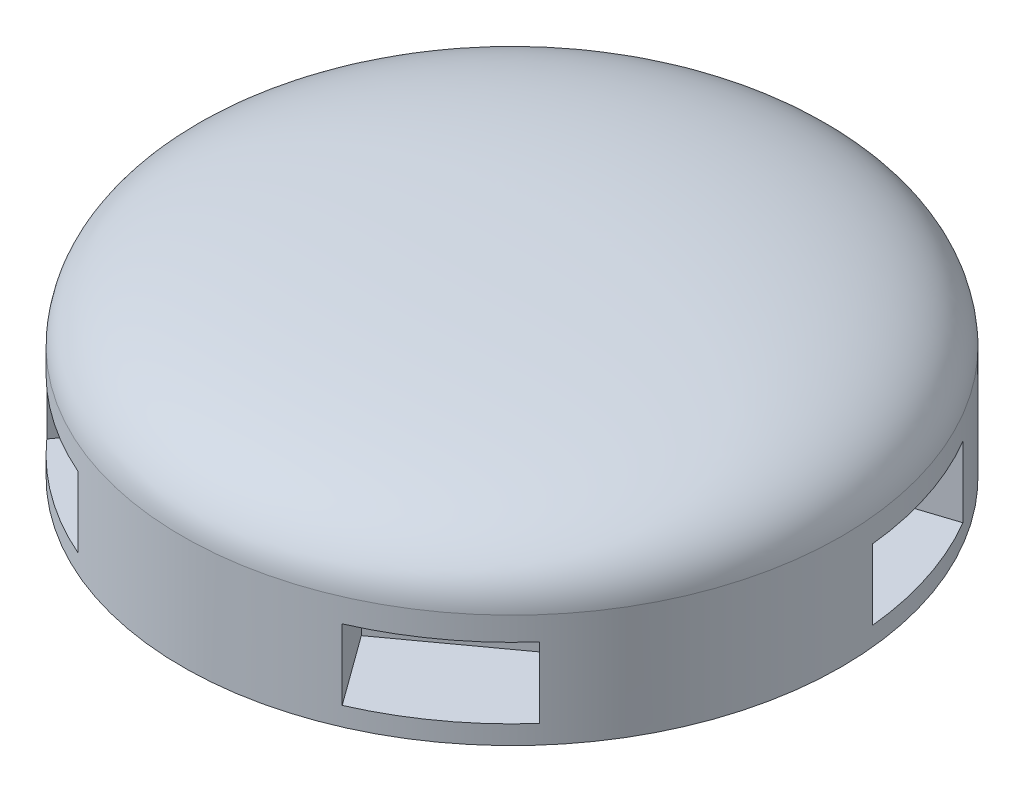
ISO-10303-21;
HEADER;
FILE_DESCRIPTION(('STEP AP214'),'2;1');
FILE_NAME('part.step','',(''),(''),'','','');
FILE_SCHEMA(('AUTOMOTIVE_DESIGN { 1 0 10303 214 1 1 1 1 }'));
ENDSEC;
DATA;
#1=APPLICATION_CONTEXT('core data for automotive mechanical design processes');
#2=APPLICATION_PROTOCOL_DEFINITION('international standard','automotive_design',2000,#1);
#3=PRODUCT_CONTEXT('',#1,'mechanical');
#4=PRODUCT('Part','Part','',(#3));
#5=PRODUCT_RELATED_PRODUCT_CATEGORY('part','',(#4));
#6=PRODUCT_DEFINITION_FORMATION('','',#4);
#7=PRODUCT_DEFINITION_CONTEXT('part definition',#1,'design');
#8=PRODUCT_DEFINITION('design','',#6,#7);
#9=PRODUCT_DEFINITION_SHAPE('','',#8);
#10=(LENGTH_UNIT() NAMED_UNIT(*) SI_UNIT(.MILLI.,.METRE.));
#11=(NAMED_UNIT(*) PLANE_ANGLE_UNIT() SI_UNIT($,.RADIAN.));
#12=(NAMED_UNIT(*) SI_UNIT($,.STERADIAN.) SOLID_ANGLE_UNIT());
#13=UNCERTAINTY_MEASURE_WITH_UNIT(LENGTH_MEASURE(1.E-05),#10,'distance_accuracy_value','');
#14=(GEOMETRIC_REPRESENTATION_CONTEXT(3) GLOBAL_UNCERTAINTY_ASSIGNED_CONTEXT((#13)) GLOBAL_UNIT_ASSIGNED_CONTEXT((#10,
#11,#12)) REPRESENTATION_CONTEXT('',''));
#15=CARTESIAN_POINT('',(0.,0.,0.));
#16=DIRECTION('',(0.,0.,1.));
#17=DIRECTION('',(1.,0.,0.));
#18=AXIS2_PLACEMENT_3D('',#15,#16,#17);
#19=CARTESIAN_POINT('',(35.,9.99999999999998,0.));
#20=CARTESIAN_POINT('',(34.8017931901627,13.4310967656326,0.));
#21=CARTESIAN_POINT('',(32.349399846197,20.,0.));
#22=CARTESIAN_POINT('',(0.,20.,0.));
#23=B_SPLINE_CURVE_WITH_KNOTS('',3,(#19,#20,#21,#22),.UNSPECIFIED.,.F.,.F.,(4,4),(0.,1.),.UNSPECIFIED.);
#24=CARTESIAN_POINT('',(0.,20.,0.));
#25=DIRECTION('',(0.,1.,0.));
#26=AXIS1_PLACEMENT('',#24,#25);
#27=SURFACE_OF_REVOLUTION('',#23,#26);
#28=CARTESIAN_POINT('',(0.,20.,0.));
#29=VERTEX_POINT('',#28);
#30=VERTEX_LOOP('',#29);
#31=FACE_BOUND('',#30,.T.);
#32=CARTESIAN_POINT('',(0.,10.,0.));
#33=DIRECTION('',(0.,1.,0.));
#34=DIRECTION('',(-1.,0.,0.));
#35=AXIS2_PLACEMENT_3D('',#32,#33,#34);
#36=CIRCLE('',#35,35.);
#37=CARTESIAN_POINT('',(-35.,10.,0.));
#38=VERTEX_POINT('',#37);
#39=EDGE_CURVE('E257',#38,#38,#36,.T.);
#40=ORIENTED_EDGE('',*,*,#39,.T.);
#41=EDGE_LOOP('',(#40));
#42=FACE_BOUND('',#41,.T.);
#43=ADVANCED_FACE('F39',(#31,#42),#27,.T.);
#44=CARTESIAN_POINT('',(0.,20.,0.));
#45=DIRECTION('',(0.,1.,0.));
#46=DIRECTION('',(-1.,0.,0.));
#47=AXIS2_PLACEMENT_3D('',#44,#45,#46);
#48=CYLINDRICAL_SURFACE('',#47,35.);
#49=CARTESIAN_POINT('',(0.,0.,0.));
#50=DIRECTION('',(0.,-1.,0.));
#51=DIRECTION('',(1.,0.,0.));
#52=AXIS2_PLACEMENT_3D('',#49,#50,#51);
#53=CIRCLE('',#52,35.);
#54=CARTESIAN_POINT('',(-7.5,0.,-34.1869858279434));
#55=VERTEX_POINT('',#54);
#56=CARTESIAN_POINT('',(7.5,0.,-34.1869858279434));
#57=VERTEX_POINT('',#56);
#58=EDGE_CURVE('E237',#55,#57,#53,.T.);
#59=ORIENTED_EDGE('',*,*,#58,.T.);
#60=DIRECTION('',(0.,1.,0.));
#61=VECTOR('',#60,1.);
#62=CARTESIAN_POINT('',(7.5,20.,-34.1869858279434));
#63=LINE('',#62,#61);
#64=CARTESIAN_POINT('',(7.5,7.5,-34.1869858279434));
#65=VERTEX_POINT('',#64);
#66=EDGE_CURVE('E11',#57,#65,#63,.T.);
#67=ORIENTED_EDGE('',*,*,#66,.T.);
#68=CARTESIAN_POINT('',(0.,7.5,0.));
#69=DIRECTION('',(0.,1.,0.));
#70=DIRECTION('',(-1.,0.,0.));
#71=AXIS2_PLACEMENT_3D('',#68,#69,#70);
#72=CIRCLE('',#71,35.);
#73=CARTESIAN_POINT('',(-7.5,7.5,-34.1869858279434));
#74=VERTEX_POINT('',#73);
#75=EDGE_CURVE('E231',#65,#74,#72,.T.);
#76=ORIENTED_EDGE('',*,*,#75,.T.);
#77=DIRECTION('',(0.,1.,0.));
#78=VECTOR('',#77,1.);
#79=CARTESIAN_POINT('',(-7.5,20.,-34.1869858279434));
#80=LINE('',#79,#78);
#81=EDGE_CURVE('E47',#74,#55,#80,.F.);
#82=ORIENTED_EDGE('',*,*,#81,.T.);
#83=EDGE_LOOP('',(#59,#67,#76,#82));
#84=FACE_BOUND('',#83,.T.);
#85=CARTESIAN_POINT('',(30.1961281863433,0.,-17.697283479504));
#86=VERTEX_POINT('',#85);
#87=CARTESIAN_POINT('',(34.8313831019677,0.,-3.43143573507673));
#88=VERTEX_POINT('',#87);
#89=EDGE_CURVE('E194',#86,#88,#53,.T.);
#90=ORIENTED_EDGE('',*,*,#89,.T.);
#91=DIRECTION('',(0.,1.,0.));
#92=VECTOR('',#91,1.);
#93=CARTESIAN_POINT('',(34.8313831019677,20.,-3.43143573507673));
#94=LINE('',#93,#92);
#95=CARTESIAN_POINT('',(34.8313831019677,7.5,-3.43143573507673));
#96=VERTEX_POINT('',#95);
#97=EDGE_CURVE('E212',#88,#96,#94,.T.);
#98=ORIENTED_EDGE('',*,*,#97,.T.);
#99=CARTESIAN_POINT('',(0.,7.5,0.));
#100=DIRECTION('',(0.,-1.,0.));
#101=DIRECTION('',(1.,0.,0.));
#102=AXIS2_PLACEMENT_3D('',#99,#100,#101);
#103=CIRCLE('',#102,35.);
#104=CARTESIAN_POINT('',(30.1961281863433,7.5,-17.697283479504));
#105=VERTEX_POINT('',#104);
#106=EDGE_CURVE('E346',#105,#96,#103,.T.);
#107=ORIENTED_EDGE('',*,*,#106,.F.);
#108=DIRECTION('',(0.,1.,0.));
#109=VECTOR('',#108,1.);
#110=CARTESIAN_POINT('',(30.1961281863433,20.,-17.697283479504));
#111=LINE('',#110,#109);
#112=EDGE_CURVE('E348',#105,#86,#111,.F.);
#113=ORIENTED_EDGE('',*,*,#112,.T.);
#114=EDGE_LOOP('',(#90,#98,#107,#113));
#115=FACE_BOUND('',#114,.T.);
#116=CARTESIAN_POINT('',(26.1622335478092,0.,23.2494631290679));
#117=VERTEX_POINT('',#116);
#118=CARTESIAN_POINT('',(14.0269786321851,0.,32.0662419134551));
#119=VERTEX_POINT('',#118);
#120=EDGE_CURVE('E180',#117,#119,#53,.T.);
#121=ORIENTED_EDGE('',*,*,#120,.T.);
#122=DIRECTION('',(0.,1.,0.));
#123=VECTOR('',#122,1.);
#124=CARTESIAN_POINT('',(14.0269786321851,20.,32.0662419134551));
#125=LINE('',#124,#123);
#126=CARTESIAN_POINT('',(14.0269786321851,7.5,32.0662419134551));
#127=VERTEX_POINT('',#126);
#128=EDGE_CURVE('E208',#119,#127,#125,.T.);
#129=ORIENTED_EDGE('',*,*,#128,.T.);
#130=CARTESIAN_POINT('',(0.,7.5,0.));
#131=DIRECTION('',(0.,-1.,0.));
#132=DIRECTION('',(1.,0.,0.));
#133=AXIS2_PLACEMENT_3D('',#130,#131,#132);
#134=CIRCLE('',#133,35.);
#135=CARTESIAN_POINT('',(26.1622335478092,7.5,23.2494631290679));
#136=VERTEX_POINT('',#135);
#137=EDGE_CURVE('E207',#136,#127,#134,.T.);
#138=ORIENTED_EDGE('',*,*,#137,.F.);
#139=DIRECTION('',(0.,1.,0.));
#140=VECTOR('',#139,1.);
#141=CARTESIAN_POINT('',(26.1622335478092,20.,23.2494631290679));
#142=LINE('',#141,#140);
#143=EDGE_CURVE('E199',#136,#117,#142,.F.);
#144=ORIENTED_EDGE('',*,*,#143,.T.);
#145=EDGE_LOOP('',(#121,#129,#138,#144));
#146=FACE_BOUND('',#145,.T.);
#147=CARTESIAN_POINT('',(-14.0269786321846,0.,32.0662419134553));
#148=VERTEX_POINT('',#147);
#149=CARTESIAN_POINT('',(-26.1622335478089,0.,23.2494631290683));
#150=VERTEX_POINT('',#149);
#151=EDGE_CURVE('E192',#148,#150,#53,.T.);
#152=ORIENTED_EDGE('',*,*,#151,.T.);
#153=DIRECTION('',(0.,1.,0.));
#154=VECTOR('',#153,1.);
#155=CARTESIAN_POINT('',(-26.1622335478089,20.,23.2494631290683));
#156=LINE('',#155,#154);
#157=CARTESIAN_POINT('',(-26.1622335478089,7.5,23.2494631290683));
#158=VERTEX_POINT('',#157);
#159=EDGE_CURVE('E220',#150,#158,#156,.T.);
#160=ORIENTED_EDGE('',*,*,#159,.T.);
#161=CARTESIAN_POINT('',(0.,7.5,0.));
#162=DIRECTION('',(0.,-1.,0.));
#163=DIRECTION('',(1.,0.,0.));
#164=AXIS2_PLACEMENT_3D('',#161,#162,#163);
#165=CIRCLE('',#164,35.);
#166=CARTESIAN_POINT('',(-14.0269786321846,7.5,32.0662419134553));
#167=VERTEX_POINT('',#166);
#168=EDGE_CURVE('E210',#167,#158,#165,.T.);
#169=ORIENTED_EDGE('',*,*,#168,.F.);
#170=DIRECTION('',(0.,1.,0.));
#171=VECTOR('',#170,1.);
#172=CARTESIAN_POINT('',(-14.0269786321846,20.,32.0662419134553));
#173=LINE('',#172,#171);
#174=EDGE_CURVE('E217',#167,#148,#173,.F.);
#175=ORIENTED_EDGE('',*,*,#174,.T.);
#176=EDGE_LOOP('',(#152,#160,#169,#175));
#177=FACE_BOUND('',#176,.T.);
#178=DIRECTION('',(0.,1.,0.));
#179=VECTOR('',#178,1.);
#180=CARTESIAN_POINT('',(-34.8313831019677,20.,-3.43143573507622));
#181=LINE('',#180,#179);
#182=CARTESIAN_POINT('',(-34.8313831019677,7.5,-3.43143573507622));
#183=VERTEX_POINT('',#182);
#184=CARTESIAN_POINT('',(-34.8313831019677,0.,-3.43143573507623));
#185=VERTEX_POINT('',#184);
#186=EDGE_CURVE('E225',#183,#185,#181,.F.);
#187=ORIENTED_EDGE('',*,*,#186,.T.);
#188=CARTESIAN_POINT('',(-30.1961281863436,0.,-17.6972834795035));
#189=VERTEX_POINT('',#188);
#190=EDGE_CURVE('E367',#185,#189,#53,.T.);
#191=ORIENTED_EDGE('',*,*,#190,.T.);
#192=DIRECTION('',(0.,1.,0.));
#193=VECTOR('',#192,1.);
#194=CARTESIAN_POINT('',(-30.1961281863435,20.,-17.6972834795035));
#195=LINE('',#194,#193);
#196=CARTESIAN_POINT('',(-30.1961281863435,7.5,-17.6972834795035));
#197=VERTEX_POINT('',#196);
#198=EDGE_CURVE('E228',#189,#197,#195,.T.);
#199=ORIENTED_EDGE('',*,*,#198,.T.);
#200=CARTESIAN_POINT('',(0.,7.5,0.));
#201=DIRECTION('',(0.,-1.,0.));
#202=DIRECTION('',(1.,0.,0.));
#203=AXIS2_PLACEMENT_3D('',#200,#201,#202);
#204=CIRCLE('',#203,35.);
#205=EDGE_CURVE('E223',#183,#197,#204,.T.);
#206=ORIENTED_EDGE('',*,*,#205,.F.);
#207=EDGE_LOOP('',(#187,#191,#199,#206));
#208=FACE_BOUND('',#207,.T.);
#209=ORIENTED_EDGE('',*,*,#39,.F.);
#210=EDGE_LOOP('',(#209));
#211=FACE_BOUND('',#210,.T.);
#212=CARTESIAN_POINT('',(0.,-2.,0.));
#213=DIRECTION('',(0.,-1.,0.));
#214=DIRECTION('',(1.,0.,0.));
#215=AXIS2_PLACEMENT_3D('',#212,#213,#214);
#216=CIRCLE('',#215,35.);
#217=CARTESIAN_POINT('',(35.,-2.,0.));
#218=VERTEX_POINT('',#217);
#219=EDGE_CURVE('E191',#218,#218,#216,.T.);
#220=ORIENTED_EDGE('',*,*,#219,.F.);
#221=EDGE_LOOP('',(#220));
#222=FACE_BOUND('',#221,.T.);
#223=ADVANCED_FACE('F205',(#84,#115,#146,#177,#208,#211,#222),#48,.T.);
#224=CARTESIAN_POINT('',(45.115170691094,7.5,-6.7728408746595));
#225=DIRECTION('',(0.309016994374958,0.,0.95105651629515));
#226=DIRECTION('',(0.95105651629515,0.,-0.309016994374958));
#227=AXIS2_PLACEMENT_3D('',#224,#225,#226);
#228=PLANE('',#227);
#229=DIRECTION('',(-0.95105651629515,0.,0.309016994374958));
#230=VECTOR('',#229,1.);
#231=CARTESIAN_POINT('',(45.115170691094,0.,-6.7728408746595));
#232=LINE('',#231,#230);
#233=CARTESIAN_POINT('',(26.0940403651909,0.,-0.592500987160338));
#234=VERTEX_POINT('',#233);
#235=EDGE_CURVE('E324',#88,#234,#232,.T.);
#236=ORIENTED_EDGE('',*,*,#235,.T.);
#237=DIRECTION('',(0.,-1.,0.));
#238=VECTOR('',#237,1.);
#239=CARTESIAN_POINT('',(26.0940403651909,7.5,-0.592500987160338));
#240=LINE('',#239,#238);
#241=CARTESIAN_POINT('',(26.0940403651909,7.5,-0.592500987160338));
#242=VERTEX_POINT('',#241);
#243=EDGE_CURVE('E321',#242,#234,#240,.T.);
#244=ORIENTED_EDGE('',*,*,#243,.F.);
#245=DIRECTION('',(-0.95105651629515,0.,0.309016994374958));
#246=VECTOR('',#245,1.);
#247=CARTESIAN_POINT('',(45.115170691094,7.5,-6.7728408746595));
#248=LINE('',#247,#246);
#249=EDGE_CURVE('E320',#96,#242,#248,.T.);
#250=ORIENTED_EDGE('',*,*,#249,.F.);
#251=ORIENTED_EDGE('',*,*,#97,.F.);
#252=EDGE_LOOP('',(#236,#244,#250,#251));
#253=FACE_BOUND('',#252,.T.);
#254=ADVANCED_FACE('F356',(#253),#228,.F.);
#255=CARTESIAN_POINT('',(40.4799157754696,7.5,-21.0386886190868));
#256=DIRECTION('',(-0.309016994374958,0.,-0.95105651629515));
#257=DIRECTION('',(-0.95105651629515,0.,0.309016994374958));
#258=AXIS2_PLACEMENT_3D('',#255,#256,#257);
#259=PLANE('',#258);
#260=DIRECTION('',(0.95105651629515,0.,-0.309016994374958));
#261=VECTOR('',#260,1.);
#262=CARTESIAN_POINT('',(40.4799157754696,7.5,-21.0386886190868));
#263=LINE('',#262,#261);
#264=CARTESIAN_POINT('',(21.4587854495666,7.5,-14.8583487315876));
#265=VERTEX_POINT('',#264);
#266=EDGE_CURVE('E334',#265,#105,#263,.T.);
#267=ORIENTED_EDGE('',*,*,#266,.F.);
#268=DIRECTION('',(0.,-1.,0.));
#269=VECTOR('',#268,1.);
#270=CARTESIAN_POINT('',(21.4587854495666,7.5,-14.8583487315876));
#271=LINE('',#270,#269);
#272=CARTESIAN_POINT('',(21.4587854495666,0.,-14.8583487315876));
#273=VERTEX_POINT('',#272);
#274=EDGE_CURVE('E317',#265,#273,#271,.T.);
#275=ORIENTED_EDGE('',*,*,#274,.T.);
#276=DIRECTION('',(0.95105651629515,0.,-0.309016994374958));
#277=VECTOR('',#276,1.);
#278=CARTESIAN_POINT('',(40.4799157754696,0.,-21.0386886190868));
#279=LINE('',#278,#277);
#280=EDGE_CURVE('E327',#273,#86,#279,.T.);
#281=ORIENTED_EDGE('',*,*,#280,.T.);
#282=ORIENTED_EDGE('',*,*,#112,.F.);
#283=EDGE_LOOP('',(#267,#275,#281,#282));
#284=FACE_BOUND('',#283,.T.);
#285=ADVANCED_FACE('F364',(#284),#259,.F.);
#286=CARTESIAN_POINT('',(0.,7.5,0.));
#287=DIRECTION('',(0.,-1.,0.));
#288=DIRECTION('',(1.,0.,0.));
#289=AXIS2_PLACEMENT_3D('',#286,#287,#288);
#290=PLANE('',#289);
#291=ORIENTED_EDGE('',*,*,#106,.T.);
#292=ORIENTED_EDGE('',*,*,#249,.T.);
#293=DIRECTION('',(-0.309016994374958,0.,-0.95105651629515));
#294=VECTOR('',#293,1.);
#295=CARTESIAN_POINT('',(21.4587854495666,7.5,-14.8583487315876));
#296=LINE('',#295,#294);
#297=EDGE_CURVE('E328',#242,#265,#296,.T.);
#298=ORIENTED_EDGE('',*,*,#297,.T.);
#299=ORIENTED_EDGE('',*,*,#266,.T.);
#300=EDGE_LOOP('',(#291,#292,#298,#299));
#301=FACE_BOUND('',#300,.T.);
#302=ADVANCED_FACE('F360',(#301),#290,.T.);
#303=CARTESIAN_POINT('',(21.4587854495666,7.5,-14.8583487315876));
#304=DIRECTION('',(-0.95105651629515,0.,0.309016994374958));
#305=DIRECTION('',(0.309016994374958,0.,0.95105651629515));
#306=AXIS2_PLACEMENT_3D('',#303,#304,#305);
#307=PLANE('',#306);
#308=DIRECTION('',(-0.309016994374958,0.,-0.95105651629515));
#309=VECTOR('',#308,1.);
#310=CARTESIAN_POINT('',(21.4587854495666,0.,-14.8583487315876));
#311=LINE('',#310,#309);
#312=EDGE_CURVE('E308',#234,#273,#311,.T.);
#313=ORIENTED_EDGE('',*,*,#312,.T.);
#314=ORIENTED_EDGE('',*,*,#274,.F.);
#315=ORIENTED_EDGE('',*,*,#297,.F.);
#316=ORIENTED_EDGE('',*,*,#243,.T.);
#317=EDGE_LOOP('',(#313,#314,#315,#316));
#318=FACE_BOUND('',#317,.T.);
#319=ADVANCED_FACE('F470',(#318),#307,.F.);
#320=CARTESIAN_POINT('',(20.3827088953496,7.5,40.814154139066));
#321=DIRECTION('',(-0.809016994374942,0.,0.58778525229248));
#322=DIRECTION('',(0.58778525229248,0.,0.809016994374942));
#323=AXIS2_PLACEMENT_3D('',#320,#321,#322);
#324=PLANE('',#323);
#325=DIRECTION('',(-0.58778525229248,0.,-0.809016994374942));
#326=VECTOR('',#325,1.);
#327=CARTESIAN_POINT('',(20.3827088953496,0.,40.814154139066));
#328=LINE('',#327,#326);
#329=CARTESIAN_POINT('',(8.62700384949994,0.,24.6338142515672));
#330=VERTEX_POINT('',#329);
#331=EDGE_CURVE('E186',#119,#330,#328,.T.);
#332=ORIENTED_EDGE('',*,*,#331,.T.);
#333=DIRECTION('',(0.,-1.,0.));
#334=VECTOR('',#333,1.);
#335=CARTESIAN_POINT('',(8.62700384949994,7.5,24.6338142515672));
#336=LINE('',#335,#334);
#337=CARTESIAN_POINT('',(8.62700384949994,7.5,24.6338142515672));
#338=VERTEX_POINT('',#337);
#339=EDGE_CURVE('E305',#338,#330,#336,.T.);
#340=ORIENTED_EDGE('',*,*,#339,.F.);
#341=DIRECTION('',(-0.58778525229248,0.,-0.809016994374942));
#342=VECTOR('',#341,1.);
#343=CARTESIAN_POINT('',(20.3827088953496,7.5,40.814154139066));
#344=LINE('',#343,#342);
#345=EDGE_CURVE('E304',#127,#338,#344,.T.);
#346=ORIENTED_EDGE('',*,*,#345,.F.);
#347=ORIENTED_EDGE('',*,*,#128,.F.);
#348=EDGE_LOOP('',(#332,#340,#346,#347));
#349=FACE_BOUND('',#348,.T.);
#350=ADVANCED_FACE('F467',(#349),#324,.F.);
#351=CARTESIAN_POINT('',(32.5179638109737,7.5,31.9973753546788));
#352=DIRECTION('',(0.809016994374942,0.,-0.58778525229248));
#353=DIRECTION('',(-0.58778525229248,0.,-0.809016994374942));
#354=AXIS2_PLACEMENT_3D('',#351,#352,#353);
#355=PLANE('',#354);
#356=DIRECTION('',(0.58778525229248,0.,0.809016994374942));
#357=VECTOR('',#356,1.);
#358=CARTESIAN_POINT('',(32.5179638109737,7.5,31.9973753546788));
#359=LINE('',#358,#357);
#360=CARTESIAN_POINT('',(20.7622587651241,7.5,15.81703546718));
#361=VERTEX_POINT('',#360);
#362=EDGE_CURVE('E313',#361,#136,#359,.T.);
#363=ORIENTED_EDGE('',*,*,#362,.F.);
#364=DIRECTION('',(0.,-1.,0.));
#365=VECTOR('',#364,1.);
#366=CARTESIAN_POINT('',(20.7622587651241,7.5,15.81703546718));
#367=LINE('',#366,#365);
#368=CARTESIAN_POINT('',(20.7622587651241,0.,15.81703546718));
#369=VERTEX_POINT('',#368);
#370=EDGE_CURVE('E201',#361,#369,#367,.T.);
#371=ORIENTED_EDGE('',*,*,#370,.T.);
#372=DIRECTION('',(0.58778525229248,0.,0.809016994374942));
#373=VECTOR('',#372,1.);
#374=CARTESIAN_POINT('',(32.5179638109737,0.,31.9973753546788));
#375=LINE('',#374,#373);
#376=EDGE_CURVE('E183',#369,#117,#375,.T.);
#377=ORIENTED_EDGE('',*,*,#376,.T.);
#378=ORIENTED_EDGE('',*,*,#143,.F.);
#379=EDGE_LOOP('',(#363,#371,#377,#378));
#380=FACE_BOUND('',#379,.T.);
#381=ADVANCED_FACE('F198',(#380),#355,.F.);
#382=CARTESIAN_POINT('',(0.,7.5,0.));
#383=DIRECTION('',(0.,-1.,0.));
#384=DIRECTION('',(1.,0.,0.));
#385=AXIS2_PLACEMENT_3D('',#382,#383,#384);
#386=PLANE('',#385);
#387=ORIENTED_EDGE('',*,*,#137,.T.);
#388=ORIENTED_EDGE('',*,*,#345,.T.);
#389=DIRECTION('',(0.809016994374942,0.,-0.58778525229248));
#390=VECTOR('',#389,1.);
#391=CARTESIAN_POINT('',(20.7622587651241,7.5,15.81703546718));
#392=LINE('',#391,#390);
#393=EDGE_CURVE('E309',#338,#361,#392,.T.);
#394=ORIENTED_EDGE('',*,*,#393,.T.);
#395=ORIENTED_EDGE('',*,*,#362,.T.);
#396=EDGE_LOOP('',(#387,#388,#394,#395));
#397=FACE_BOUND('',#396,.T.);
#398=ADVANCED_FACE('F463',(#397),#386,.T.);
#399=CARTESIAN_POINT('',(20.7622587651241,7.5,15.81703546718));
#400=DIRECTION('',(-0.58778525229248,0.,-0.809016994374942));
#401=DIRECTION('',(-0.809016994374942,0.,0.58778525229248));
#402=AXIS2_PLACEMENT_3D('',#399,#400,#401);
#403=PLANE('',#402);
#404=DIRECTION('',(0.809016994374942,0.,-0.58778525229248));
#405=VECTOR('',#404,1.);
#406=CARTESIAN_POINT('',(20.7622587651241,0.,15.81703546718));
#407=LINE('',#406,#405);
#408=EDGE_CURVE('E203',#330,#369,#407,.T.);
#409=ORIENTED_EDGE('',*,*,#408,.T.);
#410=ORIENTED_EDGE('',*,*,#370,.F.);
#411=ORIENTED_EDGE('',*,*,#393,.F.);
#412=ORIENTED_EDGE('',*,*,#339,.T.);
#413=EDGE_LOOP('',(#409,#410,#411,#412));
#414=FACE_BOUND('',#413,.T.);
#415=ADVANCED_FACE('F459',(#414),#403,.F.);
#416=CARTESIAN_POINT('',(-32.5179638109732,7.5,31.9973753546793));
#417=DIRECTION('',(-0.809016994374951,0.,-0.587785252292469));
#418=DIRECTION('',(-0.587785252292469,0.,0.809016994374951));
#419=AXIS2_PLACEMENT_3D('',#416,#417,#418);
#420=PLANE('',#419);
#421=DIRECTION('',(0.587785252292469,0.,-0.809016994374951));
#422=VECTOR('',#421,1.);
#423=CARTESIAN_POINT('',(-32.5179638109732,0.,31.9973753546793));
#424=LINE('',#423,#422);
#425=CARTESIAN_POINT('',(-20.7622587651238,0.,15.8170354671803));
#426=VERTEX_POINT('',#425);
#427=EDGE_CURVE('E289',#150,#426,#424,.T.);
#428=ORIENTED_EDGE('',*,*,#427,.T.);
#429=DIRECTION('',(0.,-1.,0.));
#430=VECTOR('',#429,1.);
#431=CARTESIAN_POINT('',(-20.7622587651238,7.5,15.8170354671803));
#432=LINE('',#431,#430);
#433=CARTESIAN_POINT('',(-20.7622587651238,7.5,15.8170354671803));
#434=VERTEX_POINT('',#433);
#435=EDGE_CURVE('E286',#434,#426,#432,.T.);
#436=ORIENTED_EDGE('',*,*,#435,.F.);
#437=DIRECTION('',(0.587785252292469,0.,-0.809016994374951));
#438=VECTOR('',#437,1.);
#439=CARTESIAN_POINT('',(-32.5179638109732,7.5,31.9973753546793));
#440=LINE('',#439,#438);
#441=EDGE_CURVE('E285',#158,#434,#440,.T.);
#442=ORIENTED_EDGE('',*,*,#441,.F.);
#443=ORIENTED_EDGE('',*,*,#159,.F.);
#444=EDGE_LOOP('',(#428,#436,#442,#443));
#445=FACE_BOUND('',#444,.T.);
#446=ADVANCED_FACE('F435',(#445),#420,.F.);
#447=CARTESIAN_POINT('',(-20.382708895349,7.5,40.8141541390663));
#448=DIRECTION('',(0.809016994374951,0.,0.587785252292469));
#449=DIRECTION('',(0.587785252292469,0.,-0.809016994374951));
#450=AXIS2_PLACEMENT_3D('',#447,#448,#449);
#451=PLANE('',#450);
#452=DIRECTION('',(-0.587785252292469,0.,0.809016994374951));
#453=VECTOR('',#452,1.);
#454=CARTESIAN_POINT('',(-20.382708895349,7.5,40.8141541390663));
#455=LINE('',#454,#453);
#456=CARTESIAN_POINT('',(-8.62700384949958,7.5,24.6338142515673));
#457=VERTEX_POINT('',#456);
#458=EDGE_CURVE('E299',#457,#167,#455,.T.);
#459=ORIENTED_EDGE('',*,*,#458,.F.);
#460=DIRECTION('',(0.,-1.,0.));
#461=VECTOR('',#460,1.);
#462=CARTESIAN_POINT('',(-8.62700384949958,7.5,24.6338142515673));
#463=LINE('',#462,#461);
#464=CARTESIAN_POINT('',(-8.62700384949958,0.,24.6338142515673));
#465=VERTEX_POINT('',#464);
#466=EDGE_CURVE('E282',#457,#465,#463,.T.);
#467=ORIENTED_EDGE('',*,*,#466,.T.);
#468=DIRECTION('',(-0.587785252292469,0.,0.809016994374951));
#469=VECTOR('',#468,1.);
#470=CARTESIAN_POINT('',(-20.382708895349,0.,40.8141541390663));
#471=LINE('',#470,#469);
#472=EDGE_CURVE('E292',#465,#148,#471,.T.);
#473=ORIENTED_EDGE('',*,*,#472,.T.);
#474=ORIENTED_EDGE('',*,*,#174,.F.);
#475=EDGE_LOOP('',(#459,#467,#473,#474));
#476=FACE_BOUND('',#475,.T.);
#477=ADVANCED_FACE('F442',(#476),#451,.F.);
#478=CARTESIAN_POINT('',(0.,7.5,0.));
#479=DIRECTION('',(0.,-1.,0.));
#480=DIRECTION('',(1.,0.,0.));
#481=AXIS2_PLACEMENT_3D('',#478,#479,#480);
#482=PLANE('',#481);
#483=ORIENTED_EDGE('',*,*,#168,.T.);
#484=ORIENTED_EDGE('',*,*,#441,.T.);
#485=DIRECTION('',(0.809016994374951,0.,0.587785252292468));
#486=VECTOR('',#485,1.);
#487=CARTESIAN_POINT('',(-8.62700384949958,7.5,24.6338142515673));
#488=LINE('',#487,#486);
#489=EDGE_CURVE('E293',#434,#457,#488,.T.);
#490=ORIENTED_EDGE('',*,*,#489,.T.);
#491=ORIENTED_EDGE('',*,*,#458,.T.);
#492=EDGE_LOOP('',(#483,#484,#490,#491));
#493=FACE_BOUND('',#492,.T.);
#494=ADVANCED_FACE('F439',(#493),#482,.T.);
#495=CARTESIAN_POINT('',(-8.62700384949958,7.5,24.6338142515673));
#496=DIRECTION('',(0.587785252292468,0.,-0.809016994374951));
#497=DIRECTION('',(-0.809016994374951,0.,-0.587785252292468));
#498=AXIS2_PLACEMENT_3D('',#495,#496,#497);
#499=PLANE('',#498);
#500=DIRECTION('',(0.809016994374951,0.,0.587785252292468));
#501=VECTOR('',#500,1.);
#502=CARTESIAN_POINT('',(-8.62700384949958,0.,24.6338142515673));
#503=LINE('',#502,#501);
#504=EDGE_CURVE('E268',#426,#465,#503,.T.);
#505=ORIENTED_EDGE('',*,*,#504,.T.);
#506=ORIENTED_EDGE('',*,*,#466,.F.);
#507=ORIENTED_EDGE('',*,*,#489,.F.);
#508=ORIENTED_EDGE('',*,*,#435,.T.);
#509=EDGE_LOOP('',(#505,#506,#507,#508));
#510=FACE_BOUND('',#509,.T.);
#511=ADVANCED_FACE('F444',(#510),#499,.F.);
#512=CARTESIAN_POINT('',(-40.4799157754699,7.5,-21.0386886190862));
#513=DIRECTION('',(0.309016994374945,0.,-0.951056516295155));
#514=DIRECTION('',(-0.951056516295155,0.,-0.309016994374945));
#515=AXIS2_PLACEMENT_3D('',#512,#513,#514);
#516=PLANE('',#515);
#517=DIRECTION('',(0.951056516295155,0.,0.309016994374945));
#518=VECTOR('',#517,1.);
#519=CARTESIAN_POINT('',(-40.4799157754699,0.,-21.0386886190862));
#520=LINE('',#519,#518);
#521=CARTESIAN_POINT('',(-21.4587854495668,0.,-14.8583487315873));
#522=VERTEX_POINT('',#521);
#523=EDGE_CURVE('E269',#189,#522,#520,.T.);
#524=ORIENTED_EDGE('',*,*,#523,.T.);
#525=DIRECTION('',(0.,-1.,0.));
#526=VECTOR('',#525,1.);
#527=CARTESIAN_POINT('',(-21.4587854495668,7.5,-14.8583487315873));
#528=LINE('',#527,#526);
#529=CARTESIAN_POINT('',(-21.4587854495668,7.5,-14.8583487315873));
#530=VERTEX_POINT('',#529);
#531=EDGE_CURVE('E265',#530,#522,#528,.T.);
#532=ORIENTED_EDGE('',*,*,#531,.F.);
#533=DIRECTION('',(0.951056516295155,0.,0.309016994374945));
#534=VECTOR('',#533,1.);
#535=CARTESIAN_POINT('',(-40.4799157754699,7.5,-21.0386886190862));
#536=LINE('',#535,#534);
#537=EDGE_CURVE('E264',#197,#530,#536,.T.);
#538=ORIENTED_EDGE('',*,*,#537,.F.);
#539=ORIENTED_EDGE('',*,*,#198,.F.);
#540=EDGE_LOOP('',(#524,#532,#538,#539));
#541=FACE_BOUND('',#540,.T.);
#542=ADVANCED_FACE('F425',(#541),#516,.F.);
#543=CARTESIAN_POINT('',(-45.1151706910941,7.5,-6.77284087465885));
#544=DIRECTION('',(-0.309016994374945,0.,0.951056516295155));
#545=DIRECTION('',(0.951056516295155,0.,0.309016994374945));
#546=AXIS2_PLACEMENT_3D('',#543,#544,#545);
#547=PLANE('',#546);
#548=DIRECTION('',(-0.951056516295155,0.,-0.309016994374945));
#549=VECTOR('',#548,1.);
#550=CARTESIAN_POINT('',(-45.1151706910941,7.5,-6.77284087465885));
#551=LINE('',#550,#549);
#552=CARTESIAN_POINT('',(-26.094040365191,7.5,-0.592500987159956));
#553=VERTEX_POINT('',#552);
#554=EDGE_CURVE('E62',#553,#183,#551,.T.);
#555=ORIENTED_EDGE('',*,*,#554,.F.);
#556=DIRECTION('',(0.,-1.,0.));
#557=VECTOR('',#556,1.);
#558=CARTESIAN_POINT('',(-26.094040365191,7.5,-0.592500987159956));
#559=LINE('',#558,#557);
#560=CARTESIAN_POINT('',(-26.094040365191,0.,-0.592500987159956));
#561=VERTEX_POINT('',#560);
#562=EDGE_CURVE('E261',#553,#561,#559,.T.);
#563=ORIENTED_EDGE('',*,*,#562,.T.);
#564=DIRECTION('',(-0.951056516295155,0.,-0.309016994374945));
#565=VECTOR('',#564,1.);
#566=CARTESIAN_POINT('',(-45.1151706910941,0.,-6.77284087465885));
#567=LINE('',#566,#565);
#568=EDGE_CURVE('E272',#561,#185,#567,.T.);
#569=ORIENTED_EDGE('',*,*,#568,.T.);
#570=ORIENTED_EDGE('',*,*,#186,.F.);
#571=EDGE_LOOP('',(#555,#563,#569,#570));
#572=FACE_BOUND('',#571,.T.);
#573=ADVANCED_FACE('F418',(#572),#547,.F.);
#574=CARTESIAN_POINT('',(0.,7.5,0.));
#575=DIRECTION('',(0.,-1.,0.));
#576=DIRECTION('',(1.,0.,0.));
#577=AXIS2_PLACEMENT_3D('',#574,#575,#576);
#578=PLANE('',#577);
#579=ORIENTED_EDGE('',*,*,#205,.T.);
#580=ORIENTED_EDGE('',*,*,#537,.T.);
#581=DIRECTION('',(-0.309016994374945,0.,0.951056516295155));
#582=VECTOR('',#581,1.);
#583=CARTESIAN_POINT('',(-26.094040365191,7.5,-0.592500987159956));
#584=LINE('',#583,#582);
#585=EDGE_CURVE('E273',#530,#553,#584,.T.);
#586=ORIENTED_EDGE('',*,*,#585,.T.);
#587=ORIENTED_EDGE('',*,*,#554,.T.);
#588=EDGE_LOOP('',(#579,#580,#586,#587));
#589=FACE_BOUND('',#588,.T.);
#590=ADVANCED_FACE('F455',(#589),#578,.T.);
#591=CARTESIAN_POINT('',(-26.094040365191,7.5,-0.592500987159956));
#592=DIRECTION('',(0.951056516295155,0.,0.309016994374945));
#593=DIRECTION('',(0.309016994374945,0.,-0.951056516295155));
#594=AXIS2_PLACEMENT_3D('',#591,#592,#593);
#595=PLANE('',#594);
#596=DIRECTION('',(-0.309016994374945,0.,0.951056516295155));
#597=VECTOR('',#596,1.);
#598=CARTESIAN_POINT('',(-26.094040365191,0.,-0.592500987159956));
#599=LINE('',#598,#597);
#600=EDGE_CURVE('E276',#522,#561,#599,.T.);
#601=ORIENTED_EDGE('',*,*,#600,.T.);
#602=ORIENTED_EDGE('',*,*,#562,.F.);
#603=ORIENTED_EDGE('',*,*,#585,.F.);
#604=ORIENTED_EDGE('',*,*,#531,.T.);
#605=EDGE_LOOP('',(#601,#602,#603,#604));
#606=FACE_BOUND('',#605,.T.);
#607=ADVANCED_FACE('F421',(#606),#595,.F.);
#608=CARTESIAN_POINT('',(7.5,7.5,-45.));
#609=DIRECTION('',(1.,0.,0.));
#610=DIRECTION('',(0.,1.,0.));
#611=AXIS2_PLACEMENT_3D('',#608,#609,#610);
#612=PLANE('',#611);
#613=DIRECTION('',(0.,0.,1.));
#614=VECTOR('',#613,1.);
#615=CARTESIAN_POINT('',(7.5,0.,-45.));
#616=LINE('',#615,#614);
#617=CARTESIAN_POINT('',(7.5,0.,-25.));
#618=VERTEX_POINT('',#617);
#619=EDGE_CURVE('E252',#57,#618,#616,.T.);
#620=ORIENTED_EDGE('',*,*,#619,.T.);
#621=DIRECTION('',(0.,-1.,0.));
#622=VECTOR('',#621,1.);
#623=CARTESIAN_POINT('',(7.5,7.5,-25.));
#624=LINE('',#623,#622);
#625=CARTESIAN_POINT('',(7.5,7.5,-25.));
#626=VERTEX_POINT('',#625);
#627=EDGE_CURVE('E258',#626,#618,#624,.T.);
#628=ORIENTED_EDGE('',*,*,#627,.F.);
#629=DIRECTION('',(0.,0.,1.));
#630=VECTOR('',#629,1.);
#631=CARTESIAN_POINT('',(7.5,7.5,-45.));
#632=LINE('',#631,#630);
#633=EDGE_CURVE('E247',#65,#626,#632,.T.);
#634=ORIENTED_EDGE('',*,*,#633,.F.);
#635=ORIENTED_EDGE('',*,*,#66,.F.);
#636=EDGE_LOOP('',(#620,#628,#634,#635));
#637=FACE_BOUND('',#636,.T.);
#638=ADVANCED_FACE('F374',(#637),#612,.F.);
#639=CARTESIAN_POINT('',(-7.5,7.5,-45.));
#640=DIRECTION('',(-1.,0.,0.));
#641=DIRECTION('',(0.,-1.,0.));
#642=AXIS2_PLACEMENT_3D('',#639,#640,#641);
#643=PLANE('',#642);
#644=DIRECTION('',(0.,0.,-1.));
#645=VECTOR('',#644,1.);
#646=CARTESIAN_POINT('',(-7.5,7.5,-45.));
#647=LINE('',#646,#645);
#648=CARTESIAN_POINT('',(-7.5,7.5,-25.));
#649=VERTEX_POINT('',#648);
#650=EDGE_CURVE('E54',#649,#74,#647,.T.);
#651=ORIENTED_EDGE('',*,*,#650,.F.);
#652=DIRECTION('',(0.,-1.,0.));
#653=VECTOR('',#652,1.);
#654=CARTESIAN_POINT('',(-7.5,7.5,-25.));
#655=LINE('',#654,#653);
#656=CARTESIAN_POINT('',(-7.5,0.,-25.));
#657=VERTEX_POINT('',#656);
#658=EDGE_CURVE('E244',#649,#657,#655,.T.);
#659=ORIENTED_EDGE('',*,*,#658,.T.);
#660=DIRECTION('',(0.,0.,-1.));
#661=VECTOR('',#660,1.);
#662=CARTESIAN_POINT('',(-7.5,0.,-45.));
#663=LINE('',#662,#661);
#664=EDGE_CURVE('E243',#657,#55,#663,.T.);
#665=ORIENTED_EDGE('',*,*,#664,.T.);
#666=ORIENTED_EDGE('',*,*,#81,.F.);
#667=EDGE_LOOP('',(#651,#659,#665,#666));
#668=FACE_BOUND('',#667,.T.);
#669=ADVANCED_FACE('F241',(#668),#643,.F.);
#670=CARTESIAN_POINT('',(0.,7.5,0.));
#671=DIRECTION('',(0.,1.,0.));
#672=DIRECTION('',(-1.,0.,0.));
#673=AXIS2_PLACEMENT_3D('',#670,#671,#672);
#674=PLANE('',#673);
#675=ORIENTED_EDGE('',*,*,#633,.T.);
#676=DIRECTION('',(-1.,0.,0.));
#677=VECTOR('',#676,1.);
#678=CARTESIAN_POINT('',(-7.5,7.5,-25.));
#679=LINE('',#678,#677);
#680=EDGE_CURVE('E250',#626,#649,#679,.T.);
#681=ORIENTED_EDGE('',*,*,#680,.T.);
#682=ORIENTED_EDGE('',*,*,#650,.T.);
#683=ORIENTED_EDGE('',*,*,#75,.F.);
#684=EDGE_LOOP('',(#675,#681,#682,#683));
#685=FACE_BOUND('',#684,.T.);
#686=ADVANCED_FACE('F379',(#685),#674,.F.);
#687=CARTESIAN_POINT('',(-7.5,7.5,-25.));
#688=DIRECTION('',(0.,0.,1.));
#689=DIRECTION('',(1.,0.,0.));
#690=AXIS2_PLACEMENT_3D('',#687,#688,#689);
#691=PLANE('',#690);
#692=DIRECTION('',(-1.,0.,0.));
#693=VECTOR('',#692,1.);
#694=CARTESIAN_POINT('',(-7.5,0.,-25.));
#695=LINE('',#694,#693);
#696=EDGE_CURVE('E248',#618,#657,#695,.T.);
#697=ORIENTED_EDGE('',*,*,#696,.T.);
#698=ORIENTED_EDGE('',*,*,#658,.F.);
#699=ORIENTED_EDGE('',*,*,#680,.F.);
#700=ORIENTED_EDGE('',*,*,#627,.T.);
#701=EDGE_LOOP('',(#697,#698,#699,#700));
#702=FACE_BOUND('',#701,.T.);
#703=ADVANCED_FACE('F378',(#702),#691,.F.);
#704=CARTESIAN_POINT('',(0.,0.,0.));
#705=DIRECTION('',(0.,-1.,0.));
#706=DIRECTION('',(1.,0.,0.));
#707=AXIS2_PLACEMENT_3D('',#704,#705,#706);
#708=PLANE('',#707);
#709=ORIENTED_EDGE('',*,*,#280,.F.);
#710=ORIENTED_EDGE('',*,*,#312,.F.);
#711=ORIENTED_EDGE('',*,*,#235,.F.);
#712=ORIENTED_EDGE('',*,*,#89,.F.);
#713=EDGE_LOOP('',(#709,#710,#711,#712));
#714=FACE_BOUND('',#713,.T.);
#715=ADVANCED_FACE('F366',(#714),#708,.F.);
#716=ORIENTED_EDGE('',*,*,#376,.F.);
#717=ORIENTED_EDGE('',*,*,#408,.F.);
#718=ORIENTED_EDGE('',*,*,#331,.F.);
#719=ORIENTED_EDGE('',*,*,#120,.F.);
#720=EDGE_LOOP('',(#716,#717,#718,#719));
#721=FACE_BOUND('',#720,.T.);
#722=ADVANCED_FACE('F182',(#721),#708,.F.);
#723=ORIENTED_EDGE('',*,*,#472,.F.);
#724=ORIENTED_EDGE('',*,*,#504,.F.);
#725=ORIENTED_EDGE('',*,*,#427,.F.);
#726=ORIENTED_EDGE('',*,*,#151,.F.);
#727=EDGE_LOOP('',(#723,#724,#725,#726));
#728=FACE_BOUND('',#727,.T.);
#729=ADVANCED_FACE('F410',(#728),#708,.F.);
#730=ORIENTED_EDGE('',*,*,#568,.F.);
#731=ORIENTED_EDGE('',*,*,#600,.F.);
#732=ORIENTED_EDGE('',*,*,#523,.F.);
#733=ORIENTED_EDGE('',*,*,#190,.F.);
#734=EDGE_LOOP('',(#730,#731,#732,#733));
#735=FACE_BOUND('',#734,.T.);
#736=ADVANCED_FACE('F404',(#735),#708,.F.);
#737=CARTESIAN_POINT('',(0.,-2.,0.));
#738=DIRECTION('',(0.,-1.,0.));
#739=DIRECTION('',(1.,0.,0.));
#740=AXIS2_PLACEMENT_3D('',#737,#738,#739);
#741=PLANE('',#740);
#742=ORIENTED_EDGE('',*,*,#219,.T.);
#743=EDGE_LOOP('',(#742));
#744=FACE_BOUND('',#743,.T.);
#745=ADVANCED_FACE('F401',(#744),#741,.T.);
#746=ORIENTED_EDGE('',*,*,#619,.F.);
#747=ORIENTED_EDGE('',*,*,#58,.F.);
#748=ORIENTED_EDGE('',*,*,#664,.F.);
#749=ORIENTED_EDGE('',*,*,#696,.F.);
#750=EDGE_LOOP('',(#746,#747,#748,#749));
#751=FACE_BOUND('',#750,.T.);
#752=ADVANCED_FACE('F403',(#751),#708,.F.);
#753=CLOSED_SHELL('',(#43,#223,#254,#285,#302,#319,#350,#381,#398,#415,#446,#477,#494,#511,#542,
#573,#590,#607,#638,#669,#686,#703,#715,#722,#729,#736,#745,#752));
#754=MANIFOLD_SOLID_BREP('B2',#753);
#755=ADVANCED_BREP_SHAPE_REPRESENTATION('',(#18,#754),#14);
#756=SHAPE_DEFINITION_REPRESENTATION(#9,#755);
ENDSEC;
END-ISO-10303-21;
